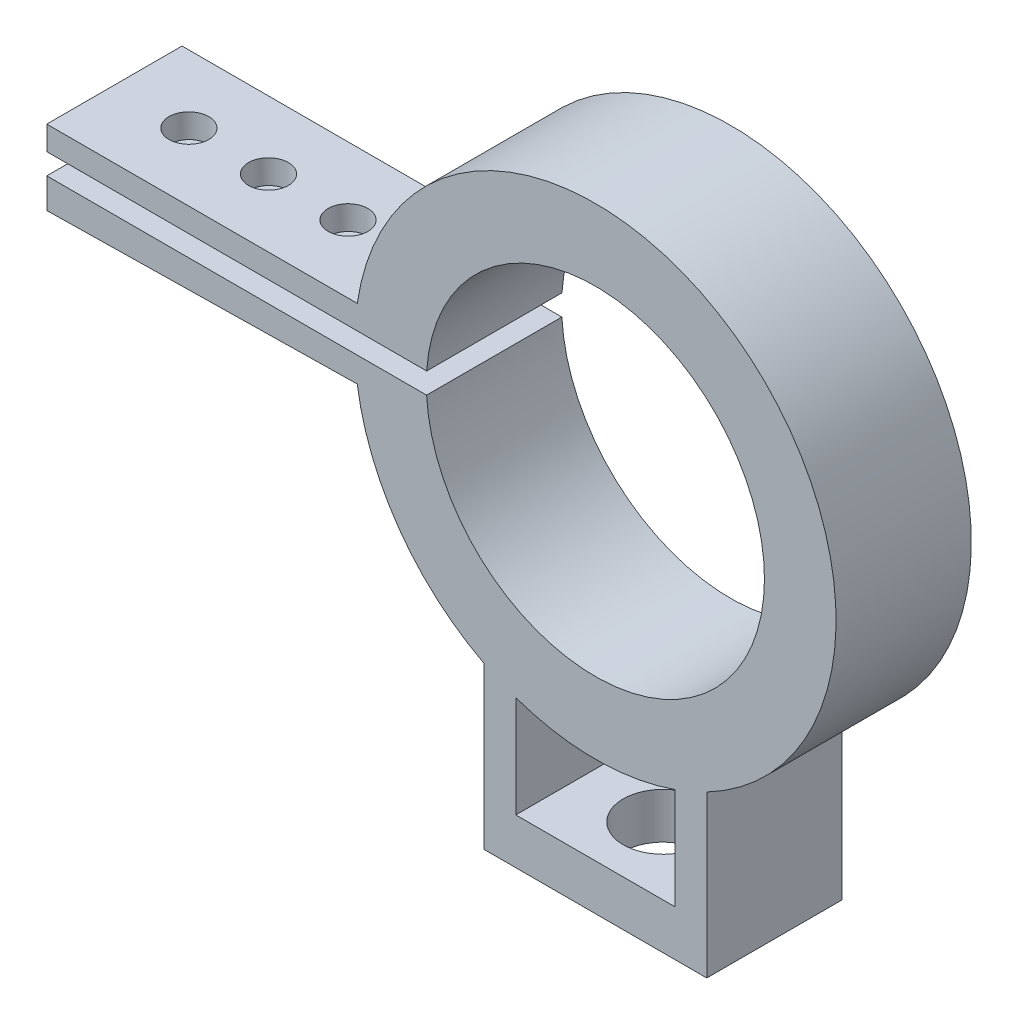
ISO-10303-21;
HEADER;
FILE_DESCRIPTION(('STEP AP214'),'2;1');
FILE_NAME('part.step','',(''),(''),'','','');
FILE_SCHEMA(('AUTOMOTIVE_DESIGN { 1 0 10303 214 1 1 1 1 }'));
ENDSEC;
DATA;
#1=APPLICATION_CONTEXT('core data for automotive mechanical design processes');
#2=APPLICATION_PROTOCOL_DEFINITION('international standard','automotive_design',2000,#1);
#3=PRODUCT_CONTEXT('',#1,'mechanical');
#4=PRODUCT('Part','Part','',(#3));
#5=PRODUCT_RELATED_PRODUCT_CATEGORY('part','',(#4));
#6=PRODUCT_DEFINITION_FORMATION('','',#4);
#7=PRODUCT_DEFINITION_CONTEXT('part definition',#1,'design');
#8=PRODUCT_DEFINITION('design','',#6,#7);
#9=PRODUCT_DEFINITION_SHAPE('','',#8);
#10=(LENGTH_UNIT() NAMED_UNIT(*) SI_UNIT(.MILLI.,.METRE.));
#11=(NAMED_UNIT(*) PLANE_ANGLE_UNIT() SI_UNIT($,.RADIAN.));
#12=(NAMED_UNIT(*) SI_UNIT($,.STERADIAN.) SOLID_ANGLE_UNIT());
#13=UNCERTAINTY_MEASURE_WITH_UNIT(LENGTH_MEASURE(1.E-05),#10,'distance_accuracy_value','');
#14=(GEOMETRIC_REPRESENTATION_CONTEXT(3) GLOBAL_UNCERTAINTY_ASSIGNED_CONTEXT((#13)) GLOBAL_UNIT_ASSIGNED_CONTEXT((#10,
#11,#12)) REPRESENTATION_CONTEXT('',''));
#15=CARTESIAN_POINT('',(0.,0.,0.));
#16=DIRECTION('',(0.,0.,1.));
#17=DIRECTION('',(1.,0.,0.));
#18=AXIS2_PLACEMENT_3D('',#15,#16,#17);
#19=CARTESIAN_POINT('',(0.,0.,17.));
#20=DIRECTION('',(0.,0.,-1.));
#21=DIRECTION('',(-1.,0.,0.));
#22=AXIS2_PLACEMENT_3D('',#19,#20,#21);
#23=CYLINDRICAL_SURFACE('',#22,30.25);
#24=CARTESIAN_POINT('',(0.,0.,0.));
#25=DIRECTION('',(0.,0.,1.));
#26=DIRECTION('',(1.,0.,0.));
#27=AXIS2_PLACEMENT_3D('',#24,#25,#26);
#28=CIRCLE('',#27,30.25);
#29=CARTESIAN_POINT('',(-29.9322407925561,-4.37303797564608,0.));
#30=VERTEX_POINT('',#29);
#31=CARTESIAN_POINT('',(-14.,-26.8153407586031,0.));
#32=VERTEX_POINT('',#31);
#33=EDGE_CURVE('E207',#30,#32,#28,.T.);
#34=ORIENTED_EDGE('',*,*,#33,.T.);
#35=DIRECTION('',(0.,0.,-1.));
#36=VECTOR('',#35,1.);
#37=CARTESIAN_POINT('',(-14.,-26.8153407586031,17.));
#38=LINE('',#37,#36);
#39=CARTESIAN_POINT('',(-14.,-26.8153407586031,17.));
#40=VERTEX_POINT('',#39);
#41=EDGE_CURVE('E11',#40,#32,#38,.T.);
#42=ORIENTED_EDGE('',*,*,#41,.F.);
#43=CARTESIAN_POINT('',(0.,0.,17.));
#44=DIRECTION('',(0.,0.,1.));
#45=DIRECTION('',(1.,0.,0.));
#46=AXIS2_PLACEMENT_3D('',#43,#44,#45);
#47=CIRCLE('',#46,30.25);
#48=CARTESIAN_POINT('',(-29.9322407925561,-4.37303797564608,17.));
#49=VERTEX_POINT('',#48);
#50=EDGE_CURVE('E311',#49,#40,#47,.T.);
#51=ORIENTED_EDGE('',*,*,#50,.F.);
#52=DIRECTION('',(0.,0.,-1.));
#53=VECTOR('',#52,1.);
#54=CARTESIAN_POINT('',(-29.9322407925561,-4.37303797564608,17.));
#55=LINE('',#54,#53);
#56=EDGE_CURVE('E248',#49,#30,#55,.T.);
#57=ORIENTED_EDGE('',*,*,#56,.T.);
#58=EDGE_LOOP('',(#34,#42,#51,#57));
#59=FACE_BOUND('',#58,.T.);
#60=ADVANCED_FACE('F41',(#59),#23,.T.);
#61=CARTESIAN_POINT('',(-14.,0.,17.));
#62=DIRECTION('',(1.,0.,0.));
#63=DIRECTION('',(0.,0.,-1.));
#64=AXIS2_PLACEMENT_3D('',#61,#62,#63);
#65=PLANE('',#64);
#66=DIRECTION('',(0.,-1.,0.));
#67=VECTOR('',#66,1.);
#68=CARTESIAN_POINT('',(-14.,0.,0.));
#69=LINE('',#68,#67);
#70=CARTESIAN_POINT('',(-14.,-47.0602881982245,0.));
#71=VERTEX_POINT('',#70);
#72=EDGE_CURVE('E211',#32,#71,#69,.T.);
#73=ORIENTED_EDGE('',*,*,#72,.T.);
#74=DIRECTION('',(0.,0.,-1.));
#75=VECTOR('',#74,1.);
#76=CARTESIAN_POINT('',(-14.,-47.0602881982245,17.));
#77=LINE('',#76,#75);
#78=CARTESIAN_POINT('',(-14.,-47.0602881982245,17.));
#79=VERTEX_POINT('',#78);
#80=EDGE_CURVE('E52',#79,#71,#77,.T.);
#81=ORIENTED_EDGE('',*,*,#80,.F.);
#82=DIRECTION('',(0.,-1.,0.));
#83=VECTOR('',#82,1.);
#84=CARTESIAN_POINT('',(-14.,0.,17.));
#85=LINE('',#84,#83);
#86=EDGE_CURVE('E316',#40,#79,#85,.T.);
#87=ORIENTED_EDGE('',*,*,#86,.F.);
#88=ORIENTED_EDGE('',*,*,#41,.T.);
#89=EDGE_LOOP('',(#73,#81,#87,#88));
#90=FACE_BOUND('',#89,.T.);
#91=ADVANCED_FACE('F368',(#90),#65,.F.);
#92=CARTESIAN_POINT('',(0.,-47.0602881982245,17.));
#93=DIRECTION('',(0.,1.,0.));
#94=DIRECTION('',(0.,0.,1.));
#95=AXIS2_PLACEMENT_3D('',#92,#93,#94);
#96=PLANE('',#95);
#97=CARTESIAN_POINT('',(0.,-47.0602881982245,8.5));
#98=DIRECTION('',(0.,-1.,0.));
#99=DIRECTION('',(0.,0.,-1.));
#100=AXIS2_PLACEMENT_3D('',#97,#98,#99);
#101=CIRCLE('',#100,5.);
#102=CARTESIAN_POINT('',(0.,-47.0602881982245,3.5));
#103=VERTEX_POINT('',#102);
#104=EDGE_CURVE('E391',#103,#103,#101,.T.);
#105=ORIENTED_EDGE('',*,*,#104,.F.);
#106=EDGE_LOOP('',(#105));
#107=FACE_BOUND('',#106,.T.);
#108=DIRECTION('',(1.,0.,0.));
#109=VECTOR('',#108,1.);
#110=CARTESIAN_POINT('',(0.,-47.0602881982245,0.));
#111=LINE('',#110,#109);
#112=CARTESIAN_POINT('',(14.,-47.0602881982245,0.));
#113=VERTEX_POINT('',#112);
#114=EDGE_CURVE('E214',#71,#113,#111,.T.);
#115=ORIENTED_EDGE('',*,*,#114,.T.);
#116=DIRECTION('',(0.,0.,-1.));
#117=VECTOR('',#116,1.);
#118=CARTESIAN_POINT('',(14.,-47.0602881982245,17.));
#119=LINE('',#118,#117);
#120=CARTESIAN_POINT('',(14.,-47.0602881982245,17.));
#121=VERTEX_POINT('',#120);
#122=EDGE_CURVE('E272',#121,#113,#119,.T.);
#123=ORIENTED_EDGE('',*,*,#122,.F.);
#124=DIRECTION('',(1.,0.,0.));
#125=VECTOR('',#124,1.);
#126=CARTESIAN_POINT('',(0.,-47.0602881982245,17.));
#127=LINE('',#126,#125);
#128=EDGE_CURVE('E323',#79,#121,#127,.T.);
#129=ORIENTED_EDGE('',*,*,#128,.F.);
#130=ORIENTED_EDGE('',*,*,#80,.T.);
#131=EDGE_LOOP('',(#115,#123,#129,#130));
#132=FACE_BOUND('',#131,.T.);
#133=ADVANCED_FACE('F373',(#107,#132),#96,.F.);
#134=CARTESIAN_POINT('',(14.,0.,17.));
#135=DIRECTION('',(-1.,0.,0.));
#136=DIRECTION('',(0.,-1.,0.));
#137=AXIS2_PLACEMENT_3D('',#134,#135,#136);
#138=PLANE('',#137);
#139=DIRECTION('',(0.,1.,0.));
#140=VECTOR('',#139,1.);
#141=CARTESIAN_POINT('',(14.,0.,0.));
#142=LINE('',#141,#140);
#143=CARTESIAN_POINT('',(14.,-26.8153407586031,0.));
#144=VERTEX_POINT('',#143);
#145=EDGE_CURVE('E217',#113,#144,#142,.T.);
#146=ORIENTED_EDGE('',*,*,#145,.T.);
#147=DIRECTION('',(0.,0.,-1.));
#148=VECTOR('',#147,1.);
#149=CARTESIAN_POINT('',(14.,-26.8153407586031,17.));
#150=LINE('',#149,#148);
#151=CARTESIAN_POINT('',(14.,-26.8153407586031,17.));
#152=VERTEX_POINT('',#151);
#153=EDGE_CURVE('E268',#152,#144,#150,.T.);
#154=ORIENTED_EDGE('',*,*,#153,.F.);
#155=DIRECTION('',(0.,1.,0.));
#156=VECTOR('',#155,1.);
#157=CARTESIAN_POINT('',(14.,0.,17.));
#158=LINE('',#157,#156);
#159=EDGE_CURVE('E326',#121,#152,#158,.T.);
#160=ORIENTED_EDGE('',*,*,#159,.F.);
#161=ORIENTED_EDGE('',*,*,#122,.T.);
#162=EDGE_LOOP('',(#146,#154,#160,#161));
#163=FACE_BOUND('',#162,.T.);
#164=ADVANCED_FACE('F487',(#163),#138,.F.);
#165=CARTESIAN_POINT('',(0.,0.,17.));
#166=DIRECTION('',(0.,0.,-1.));
#167=DIRECTION('',(-1.,0.,0.));
#168=AXIS2_PLACEMENT_3D('',#165,#166,#167);
#169=CYLINDRICAL_SURFACE('',#168,30.25);
#170=CARTESIAN_POINT('',(0.,0.,0.));
#171=DIRECTION('',(0.,0.,1.));
#172=DIRECTION('',(1.,0.,0.));
#173=AXIS2_PLACEMENT_3D('',#170,#171,#172);
#174=CIRCLE('',#173,30.25);
#175=CARTESIAN_POINT('',(-29.9274999124546,4.40536593145532,0.));
#176=VERTEX_POINT('',#175);
#177=EDGE_CURVE('E220',#144,#176,#174,.T.);
#178=ORIENTED_EDGE('',*,*,#177,.T.);
#179=DIRECTION('',(0.,0.,-1.));
#180=VECTOR('',#179,1.);
#181=CARTESIAN_POINT('',(-29.9274999124546,4.40536593145532,17.));
#182=LINE('',#181,#180);
#183=CARTESIAN_POINT('',(-29.9274999124546,4.40536593145532,17.));
#184=VERTEX_POINT('',#183);
#185=EDGE_CURVE('E265',#184,#176,#182,.T.);
#186=ORIENTED_EDGE('',*,*,#185,.F.);
#187=CARTESIAN_POINT('',(0.,0.,17.));
#188=DIRECTION('',(0.,0.,1.));
#189=DIRECTION('',(1.,0.,0.));
#190=AXIS2_PLACEMENT_3D('',#187,#188,#189);
#191=CIRCLE('',#190,30.25);
#192=EDGE_CURVE('E329',#152,#184,#191,.T.);
#193=ORIENTED_EDGE('',*,*,#192,.F.);
#194=ORIENTED_EDGE('',*,*,#153,.T.);
#195=EDGE_LOOP('',(#178,#186,#193,#194));
#196=FACE_BOUND('',#195,.T.);
#197=ADVANCED_FACE('F483',(#196),#169,.T.);
#198=CARTESIAN_POINT('',(0.,4.40536593145532,17.));
#199=DIRECTION('',(0.,1.,0.));
#200=DIRECTION('',(0.,0.,1.));
#201=AXIS2_PLACEMENT_3D('',#198,#199,#200);
#202=PLANE('',#201);
#203=CARTESIAN_POINT('',(-59.5889076622242,4.40536593145532,8.49999999999993));
#204=DIRECTION('',(0.,1.,0.));
#205=DIRECTION('',(1.,0.,0.));
#206=AXIS2_PLACEMENT_3D('',#203,#204,#205);
#207=ELLIPSE('',#206,2.50032271693993,2.5);
#208=CARTESIAN_POINT('',(-57.0885849452843,4.40536593145532,8.49999999999993));
#209=VERTEX_POINT('',#208);
#210=EDGE_CURVE('E394',#209,#209,#207,.T.);
#211=ORIENTED_EDGE('',*,*,#210,.F.);
#212=EDGE_LOOP('',(#211));
#213=FACE_BOUND('',#212,.T.);
#214=CARTESIAN_POINT('',(-39.5863259267049,4.40536593145532,8.5));
#215=DIRECTION('',(0.,1.,0.));
#216=DIRECTION('',(1.,0.,0.));
#217=AXIS2_PLACEMENT_3D('',#214,#215,#216);
#218=ELLIPSE('',#217,2.50032271693993,2.5);
#219=CARTESIAN_POINT('',(-37.0860032097649,4.40536593145532,8.5));
#220=VERTEX_POINT('',#219);
#221=EDGE_CURVE('E413',#220,#220,#218,.T.);
#222=ORIENTED_EDGE('',*,*,#221,.F.);
#223=EDGE_LOOP('',(#222));
#224=FACE_BOUND('',#223,.T.);
#225=CARTESIAN_POINT('',(-49.5876167944646,4.40536593145532,8.5));
#226=DIRECTION('',(0.,1.,0.));
#227=DIRECTION('',(1.,0.,0.));
#228=AXIS2_PLACEMENT_3D('',#225,#226,#227);
#229=ELLIPSE('',#228,2.50032271693992,2.5);
#230=CARTESIAN_POINT('',(-47.0872940775246,4.40536593145532,8.5));
#231=VERTEX_POINT('',#230);
#232=EDGE_CURVE('E425',#231,#231,#229,.T.);
#233=ORIENTED_EDGE('',*,*,#232,.F.);
#234=EDGE_LOOP('',(#233));
#235=FACE_BOUND('',#234,.T.);
#236=DIRECTION('',(1.,0.,0.));
#237=VECTOR('',#236,1.);
#238=CARTESIAN_POINT('',(0.,4.40536593145532,0.));
#239=LINE('',#238,#237);
#240=CARTESIAN_POINT('',(-68.9508105555163,4.40536593145532,0.));
#241=VERTEX_POINT('',#240);
#242=EDGE_CURVE('E224',#241,#176,#239,.T.);
#243=ORIENTED_EDGE('',*,*,#242,.F.);
#244=DIRECTION('',(0.,0.,-1.));
#245=VECTOR('',#244,1.);
#246=CARTESIAN_POINT('',(-68.9508105555163,4.40536593145532,17.));
#247=LINE('',#246,#245);
#248=CARTESIAN_POINT('',(-68.9508105555163,4.40536593145532,17.));
#249=VERTEX_POINT('',#248);
#250=EDGE_CURVE('E262',#249,#241,#247,.T.);
#251=ORIENTED_EDGE('',*,*,#250,.F.);
#252=DIRECTION('',(1.,0.,0.));
#253=VECTOR('',#252,1.);
#254=CARTESIAN_POINT('',(0.,4.40536593145532,17.));
#255=LINE('',#254,#253);
#256=EDGE_CURVE('E332',#249,#184,#255,.T.);
#257=ORIENTED_EDGE('',*,*,#256,.T.);
#258=ORIENTED_EDGE('',*,*,#185,.T.);
#259=EDGE_LOOP('',(#243,#251,#257,#258));
#260=FACE_BOUND('',#259,.T.);
#261=ADVANCED_FACE('F479',(#213,#224,#235,#260),#202,.T.);
#262=CARTESIAN_POINT('',(-68.9508105555163,0.,17.));
#263=DIRECTION('',(-1.,0.,0.));
#264=DIRECTION('',(0.,0.,1.));
#265=AXIS2_PLACEMENT_3D('',#262,#263,#264);
#266=PLANE('',#265);
#267=DIRECTION('',(0.,1.,0.));
#268=VECTOR('',#267,1.);
#269=CARTESIAN_POINT('',(-68.9508105555163,0.,0.));
#270=LINE('',#269,#268);
#271=CARTESIAN_POINT('',(-68.9508105555163,1.40536593145532,0.));
#272=VERTEX_POINT('',#271);
#273=EDGE_CURVE('E228',#272,#241,#270,.T.);
#274=ORIENTED_EDGE('',*,*,#273,.F.);
#275=DIRECTION('',(0.,0.,-1.));
#276=VECTOR('',#275,1.);
#277=CARTESIAN_POINT('',(-68.9508105555163,1.40536593145532,17.));
#278=LINE('',#277,#276);
#279=CARTESIAN_POINT('',(-68.9508105555163,1.40536593145532,17.));
#280=VERTEX_POINT('',#279);
#281=EDGE_CURVE('E259',#280,#272,#278,.T.);
#282=ORIENTED_EDGE('',*,*,#281,.F.);
#283=DIRECTION('',(0.,1.,0.));
#284=VECTOR('',#283,1.);
#285=CARTESIAN_POINT('',(-68.9508105555163,0.,17.));
#286=LINE('',#285,#284);
#287=EDGE_CURVE('E336',#280,#249,#286,.T.);
#288=ORIENTED_EDGE('',*,*,#287,.T.);
#289=ORIENTED_EDGE('',*,*,#250,.T.);
#290=EDGE_LOOP('',(#274,#282,#288,#289));
#291=FACE_BOUND('',#290,.T.);
#292=ADVANCED_FACE('F475',(#291),#266,.T.);
#293=CARTESIAN_POINT('',(0.,1.40536593145532,17.));
#294=DIRECTION('',(0.,-1.,0.));
#295=DIRECTION('',(0.,0.,-1.));
#296=AXIS2_PLACEMENT_3D('',#293,#294,#295);
#297=PLANE('',#296);
#298=CARTESIAN_POINT('',(-59.5407027668504,1.40536593145532,8.49999999999993));
#299=DIRECTION('',(0.,-1.,0.));
#300=DIRECTION('',(1.,0.,0.));
#301=AXIS2_PLACEMENT_3D('',#298,#299,#300);
#302=ELLIPSE('',#301,2.50032271693993,2.5);
#303=CARTESIAN_POINT('',(-57.0403800499104,1.40536593145532,8.49999999999993));
#304=VERTEX_POINT('',#303);
#305=EDGE_CURVE('E400',#304,#304,#302,.T.);
#306=ORIENTED_EDGE('',*,*,#305,.F.);
#307=EDGE_LOOP('',(#306));
#308=FACE_BOUND('',#307,.T.);
#309=CARTESIAN_POINT('',(-39.538121031331,1.40536593145532,8.5));
#310=DIRECTION('',(0.,-1.,0.));
#311=DIRECTION('',(1.,0.,0.));
#312=AXIS2_PLACEMENT_3D('',#309,#310,#311);
#313=ELLIPSE('',#312,2.50032271693993,2.5);
#314=CARTESIAN_POINT('',(-37.0377983143911,1.40536593145532,8.5));
#315=VERTEX_POINT('',#314);
#316=EDGE_CURVE('E417',#315,#315,#313,.T.);
#317=ORIENTED_EDGE('',*,*,#316,.F.);
#318=EDGE_LOOP('',(#317));
#319=FACE_BOUND('',#318,.T.);
#320=CARTESIAN_POINT('',(-49.5394118990907,1.40536593145532,8.5));
#321=DIRECTION('',(0.,-1.,0.));
#322=DIRECTION('',(1.,0.,0.));
#323=AXIS2_PLACEMENT_3D('',#320,#321,#322);
#324=ELLIPSE('',#323,2.50032271693992,2.5);
#325=CARTESIAN_POINT('',(-47.0390891821508,1.40536593145532,8.5));
#326=VERTEX_POINT('',#325);
#327=EDGE_CURVE('E429',#326,#326,#324,.T.);
#328=ORIENTED_EDGE('',*,*,#327,.F.);
#329=EDGE_LOOP('',(#328));
#330=FACE_BOUND('',#329,.T.);
#331=DIRECTION('',(-1.,0.,0.));
#332=VECTOR('',#331,1.);
#333=CARTESIAN_POINT('',(0.,1.40536593145532,0.));
#334=LINE('',#333,#332);
#335=CARTESIAN_POINT('',(-21.2034772289524,1.40536593145532,0.));
#336=VERTEX_POINT('',#335);
#337=EDGE_CURVE('E232',#336,#272,#334,.T.);
#338=ORIENTED_EDGE('',*,*,#337,.F.);
#339=DIRECTION('',(0.,0.,-1.));
#340=VECTOR('',#339,1.);
#341=CARTESIAN_POINT('',(-21.2034772289524,1.40536593145532,17.));
#342=LINE('',#341,#340);
#343=CARTESIAN_POINT('',(-21.2034772289524,1.40536593145532,17.));
#344=VERTEX_POINT('',#343);
#345=EDGE_CURVE('E256',#344,#336,#342,.T.);
#346=ORIENTED_EDGE('',*,*,#345,.F.);
#347=DIRECTION('',(-1.,0.,0.));
#348=VECTOR('',#347,1.);
#349=CARTESIAN_POINT('',(0.,1.40536593145532,17.));
#350=LINE('',#349,#348);
#351=EDGE_CURVE('E340',#344,#280,#350,.T.);
#352=ORIENTED_EDGE('',*,*,#351,.T.);
#353=ORIENTED_EDGE('',*,*,#281,.T.);
#354=EDGE_LOOP('',(#338,#346,#352,#353));
#355=FACE_BOUND('',#354,.T.);
#356=ADVANCED_FACE('F469',(#308,#319,#330,#355),#297,.T.);
#357=CARTESIAN_POINT('',(0.,0.,17.));
#358=DIRECTION('',(0.,0.,-1.));
#359=DIRECTION('',(-1.,0.,0.));
#360=AXIS2_PLACEMENT_3D('',#357,#358,#359);
#361=CYLINDRICAL_SURFACE('',#360,21.25);
#362=CARTESIAN_POINT('',(0.,0.,0.));
#363=DIRECTION('',(0.,0.,1.));
#364=DIRECTION('',(1.,0.,0.));
#365=AXIS2_PLACEMENT_3D('',#362,#363,#364);
#366=CIRCLE('',#365,21.25);
#367=CARTESIAN_POINT('',(-21.2145631797598,-1.22670660387081,0.));
#368=VERTEX_POINT('',#367);
#369=EDGE_CURVE('E236',#368,#336,#366,.T.);
#370=ORIENTED_EDGE('',*,*,#369,.F.);
#371=DIRECTION('',(0.,0.,-1.));
#372=VECTOR('',#371,1.);
#373=CARTESIAN_POINT('',(-21.2145631797598,-1.22670660387081,17.));
#374=LINE('',#373,#372);
#375=CARTESIAN_POINT('',(-21.2145631797598,-1.22670660387081,17.));
#376=VERTEX_POINT('',#375);
#377=EDGE_CURVE('E184',#376,#368,#374,.T.);
#378=ORIENTED_EDGE('',*,*,#377,.F.);
#379=CARTESIAN_POINT('',(0.,0.,17.));
#380=DIRECTION('',(0.,0.,1.));
#381=DIRECTION('',(1.,0.,0.));
#382=AXIS2_PLACEMENT_3D('',#379,#380,#381);
#383=CIRCLE('',#382,21.25);
#384=EDGE_CURVE('E171',#376,#344,#383,.T.);
#385=ORIENTED_EDGE('',*,*,#384,.T.);
#386=ORIENTED_EDGE('',*,*,#345,.T.);
#387=EDGE_LOOP('',(#370,#378,#385,#386));
#388=FACE_BOUND('',#387,.T.);
#389=ADVANCED_FACE('F346',(#388),#361,.F.);
#390=CARTESIAN_POINT('',(0.,-1.22670660387081,17.));
#391=DIRECTION('',(0.,-1.,0.));
#392=DIRECTION('',(0.,0.,-1.));
#393=AXIS2_PLACEMENT_3D('',#390,#391,#392);
#394=PLANE('',#393);
#395=CARTESIAN_POINT('',(-59.4984098397898,-1.22670660387081,8.49999999999993));
#396=DIRECTION('',(0.,-1.,0.));
#397=DIRECTION('',(1.,0.,0.));
#398=AXIS2_PLACEMENT_3D('',#395,#396,#397);
#399=ELLIPSE('',#398,2.50032271693993,2.5);
#400=CARTESIAN_POINT('',(-56.9980871228498,-1.22670660387081,8.49999999999993));
#401=VERTEX_POINT('',#400);
#402=EDGE_CURVE('E409',#401,#401,#399,.T.);
#403=ORIENTED_EDGE('',*,*,#402,.T.);
#404=EDGE_LOOP('',(#403));
#405=FACE_BOUND('',#404,.T.);
#406=CARTESIAN_POINT('',(-39.4958281042704,-1.22670660387081,8.5));
#407=DIRECTION('',(0.,-1.,0.));
#408=DIRECTION('',(1.,0.,0.));
#409=AXIS2_PLACEMENT_3D('',#406,#407,#408);
#410=ELLIPSE('',#409,2.50032271693993,2.5);
#411=CARTESIAN_POINT('',(-36.9955053873304,-1.22670660387081,8.5));
#412=VERTEX_POINT('',#411);
#413=EDGE_CURVE('E421',#412,#412,#410,.T.);
#414=ORIENTED_EDGE('',*,*,#413,.T.);
#415=EDGE_LOOP('',(#414));
#416=FACE_BOUND('',#415,.T.);
#417=CARTESIAN_POINT('',(-49.4971189720301,-1.22670660387081,8.5));
#418=DIRECTION('',(0.,-1.,0.));
#419=DIRECTION('',(1.,0.,0.));
#420=AXIS2_PLACEMENT_3D('',#417,#418,#419);
#421=ELLIPSE('',#420,2.50032271693992,2.5);
#422=CARTESIAN_POINT('',(-46.9967962550901,-1.22670660387081,8.5));
#423=VERTEX_POINT('',#422);
#424=EDGE_CURVE('E433',#423,#423,#421,.T.);
#425=ORIENTED_EDGE('',*,*,#424,.T.);
#426=EDGE_LOOP('',(#425));
#427=FACE_BOUND('',#426,.T.);
#428=DIRECTION('',(-1.,0.,0.));
#429=VECTOR('',#428,1.);
#430=CARTESIAN_POINT('',(0.,-1.22670660387081,0.));
#431=LINE('',#430,#429);
#432=CARTESIAN_POINT('',(-68.9508105555163,-1.22670660387081,0.));
#433=VERTEX_POINT('',#432);
#434=EDGE_CURVE('E179',#368,#433,#431,.T.);
#435=ORIENTED_EDGE('',*,*,#434,.T.);
#436=DIRECTION('',(0.,0.,-1.));
#437=VECTOR('',#436,1.);
#438=CARTESIAN_POINT('',(-68.9508105555163,-1.22670660387081,17.));
#439=LINE('',#438,#437);
#440=CARTESIAN_POINT('',(-68.9508105555163,-1.22670660387081,17.));
#441=VERTEX_POINT('',#440);
#442=EDGE_CURVE('E176',#441,#433,#439,.T.);
#443=ORIENTED_EDGE('',*,*,#442,.F.);
#444=DIRECTION('',(-1.,0.,0.));
#445=VECTOR('',#444,1.);
#446=CARTESIAN_POINT('',(0.,-1.22670660387081,17.));
#447=LINE('',#446,#445);
#448=EDGE_CURVE('E164',#376,#441,#447,.T.);
#449=ORIENTED_EDGE('',*,*,#448,.F.);
#450=ORIENTED_EDGE('',*,*,#377,.T.);
#451=EDGE_LOOP('',(#435,#443,#449,#450));
#452=FACE_BOUND('',#451,.T.);
#453=ADVANCED_FACE('F177',(#405,#416,#427,#452),#394,.F.);
#454=CARTESIAN_POINT('',(-68.9508105555163,0.,17.));
#455=DIRECTION('',(-1.,0.,0.));
#456=DIRECTION('',(0.,0.,1.));
#457=AXIS2_PLACEMENT_3D('',#454,#455,#456);
#458=PLANE('',#457);
#459=DIRECTION('',(0.,1.,0.));
#460=VECTOR('',#459,1.);
#461=CARTESIAN_POINT('',(-68.9508105555163,0.,0.));
#462=LINE('',#461,#460);
#463=CARTESIAN_POINT('',(-68.9508105555163,-5.,0.));
#464=VERTEX_POINT('',#463);
#465=EDGE_CURVE('E242',#464,#433,#462,.T.);
#466=ORIENTED_EDGE('',*,*,#465,.F.);
#467=DIRECTION('',(0.,0.,-1.));
#468=VECTOR('',#467,1.);
#469=CARTESIAN_POINT('',(-68.9508105555163,-5.,17.));
#470=LINE('',#469,#468);
#471=CARTESIAN_POINT('',(-68.9508105555163,-5.,17.));
#472=VERTEX_POINT('',#471);
#473=EDGE_CURVE('E113',#472,#464,#470,.T.);
#474=ORIENTED_EDGE('',*,*,#473,.F.);
#475=DIRECTION('',(0.,1.,0.));
#476=VECTOR('',#475,1.);
#477=CARTESIAN_POINT('',(-68.9508105555163,0.,17.));
#478=LINE('',#477,#476);
#479=EDGE_CURVE('E168',#472,#441,#478,.T.);
#480=ORIENTED_EDGE('',*,*,#479,.T.);
#481=ORIENTED_EDGE('',*,*,#442,.T.);
#482=EDGE_LOOP('',(#466,#474,#480,#481));
#483=FACE_BOUND('',#482,.T.);
#484=ADVANCED_FACE('F186',(#483),#458,.T.);
#485=CARTESIAN_POINT('',(0.,-41.3102881982245,17.));
#486=DIRECTION('',(0.,-1.,0.));
#487=DIRECTION('',(0.,0.,-1.));
#488=AXIS2_PLACEMENT_3D('',#485,#486,#487);
#489=PLANE('',#488);
#490=CARTESIAN_POINT('',(0.,-41.3102881982245,8.5));
#491=DIRECTION('',(0.,-1.,0.));
#492=DIRECTION('',(0.,0.,-1.));
#493=AXIS2_PLACEMENT_3D('',#490,#491,#492);
#494=CIRCLE('',#493,5.);
#495=CARTESIAN_POINT('',(0.,-41.3102881982245,3.5));
#496=VERTEX_POINT('',#495);
#497=EDGE_CURVE('E45',#496,#496,#494,.T.);
#498=ORIENTED_EDGE('',*,*,#497,.T.);
#499=EDGE_LOOP('',(#498));
#500=FACE_BOUND('',#499,.T.);
#501=DIRECTION('',(-1.,0.,0.));
#502=VECTOR('',#501,1.);
#503=CARTESIAN_POINT('',(0.,-41.3102881982245,0.));
#504=LINE('',#503,#502);
#505=CARTESIAN_POINT('',(10.,-41.3102881982245,0.));
#506=VERTEX_POINT('',#505);
#507=CARTESIAN_POINT('',(-9.99999999999999,-41.3102881982245,0.));
#508=VERTEX_POINT('',#507);
#509=EDGE_CURVE('E194',#506,#508,#504,.T.);
#510=ORIENTED_EDGE('',*,*,#509,.T.);
#511=DIRECTION('',(0.,0.,-1.));
#512=VECTOR('',#511,1.);
#513=CARTESIAN_POINT('',(-9.99999999999999,-41.3102881982245,17.));
#514=LINE('',#513,#512);
#515=CARTESIAN_POINT('',(-9.99999999999999,-41.3102881982245,17.));
#516=VERTEX_POINT('',#515);
#517=EDGE_CURVE('E251',#516,#508,#514,.T.);
#518=ORIENTED_EDGE('',*,*,#517,.F.);
#519=DIRECTION('',(-1.,0.,0.));
#520=VECTOR('',#519,1.);
#521=CARTESIAN_POINT('',(0.,-41.3102881982245,17.));
#522=LINE('',#521,#520);
#523=CARTESIAN_POINT('',(10.,-41.3102881982245,17.));
#524=VERTEX_POINT('',#523);
#525=EDGE_CURVE('E247',#524,#516,#522,.T.);
#526=ORIENTED_EDGE('',*,*,#525,.F.);
#527=DIRECTION('',(0.,0.,-1.));
#528=VECTOR('',#527,1.);
#529=CARTESIAN_POINT('',(10.,-41.3102881982245,17.));
#530=LINE('',#529,#528);
#531=EDGE_CURVE('E190',#524,#506,#530,.T.);
#532=ORIENTED_EDGE('',*,*,#531,.T.);
#533=EDGE_LOOP('',(#510,#518,#526,#532));
#534=FACE_BOUND('',#533,.T.);
#535=ADVANCED_FACE('F43',(#500,#534),#489,.F.);
#536=CARTESIAN_POINT('',(-9.99999999999999,0.,17.));
#537=DIRECTION('',(-1.,0.,0.));
#538=DIRECTION('',(0.,-1.,0.));
#539=AXIS2_PLACEMENT_3D('',#536,#537,#538);
#540=PLANE('',#539);
#541=DIRECTION('',(0.,1.,0.));
#542=VECTOR('',#541,1.);
#543=CARTESIAN_POINT('',(-9.99999999999999,0.,0.));
#544=LINE('',#543,#542);
#545=CARTESIAN_POINT('',(-9.99999999999999,-28.5492994660114,0.));
#546=VERTEX_POINT('',#545);
#547=EDGE_CURVE('E198',#508,#546,#544,.T.);
#548=ORIENTED_EDGE('',*,*,#547,.T.);
#549=DIRECTION('',(0.,0.,-1.));
#550=VECTOR('',#549,1.);
#551=CARTESIAN_POINT('',(-9.99999999999999,-28.5492994660114,17.));
#552=LINE('',#551,#550);
#553=CARTESIAN_POINT('',(-9.99999999999999,-28.5492994660114,17.));
#554=VERTEX_POINT('',#553);
#555=EDGE_CURVE('E286',#554,#546,#552,.T.);
#556=ORIENTED_EDGE('',*,*,#555,.F.);
#557=DIRECTION('',(0.,1.,0.));
#558=VECTOR('',#557,1.);
#559=CARTESIAN_POINT('',(-9.99999999999999,0.,17.));
#560=LINE('',#559,#558);
#561=EDGE_CURVE('E125',#516,#554,#560,.T.);
#562=ORIENTED_EDGE('',*,*,#561,.F.);
#563=ORIENTED_EDGE('',*,*,#517,.T.);
#564=EDGE_LOOP('',(#548,#556,#562,#563));
#565=FACE_BOUND('',#564,.T.);
#566=ADVANCED_FACE('F291',(#565),#540,.F.);
#567=CARTESIAN_POINT('',(0.,0.,17.));
#568=DIRECTION('',(0.,0.,-1.));
#569=DIRECTION('',(-1.,0.,0.));
#570=AXIS2_PLACEMENT_3D('',#567,#568,#569);
#571=CYLINDRICAL_SURFACE('',#570,30.25);
#572=CARTESIAN_POINT('',(0.,0.,0.));
#573=DIRECTION('',(0.,0.,1.));
#574=DIRECTION('',(1.,0.,0.));
#575=AXIS2_PLACEMENT_3D('',#572,#573,#574);
#576=CIRCLE('',#575,30.25);
#577=CARTESIAN_POINT('',(10.,-28.5492994660114,0.));
#578=VERTEX_POINT('',#577);
#579=EDGE_CURVE('E201',#546,#578,#576,.T.);
#580=ORIENTED_EDGE('',*,*,#579,.T.);
#581=DIRECTION('',(0.,0.,-1.));
#582=VECTOR('',#581,1.);
#583=CARTESIAN_POINT('',(10.,-28.5492994660114,17.));
#584=LINE('',#583,#582);
#585=CARTESIAN_POINT('',(10.,-28.5492994660114,17.));
#586=VERTEX_POINT('',#585);
#587=EDGE_CURVE('E282',#586,#578,#584,.T.);
#588=ORIENTED_EDGE('',*,*,#587,.F.);
#589=CARTESIAN_POINT('',(0.,0.,17.));
#590=DIRECTION('',(0.,0.,1.));
#591=DIRECTION('',(1.,0.,0.));
#592=AXIS2_PLACEMENT_3D('',#589,#590,#591);
#593=CIRCLE('',#592,30.25);
#594=EDGE_CURVE('E312',#554,#586,#593,.T.);
#595=ORIENTED_EDGE('',*,*,#594,.F.);
#596=ORIENTED_EDGE('',*,*,#555,.T.);
#597=EDGE_LOOP('',(#580,#588,#595,#596));
#598=FACE_BOUND('',#597,.T.);
#599=ADVANCED_FACE('F303',(#598),#571,.T.);
#600=CARTESIAN_POINT('',(10.,0.,17.));
#601=DIRECTION('',(1.,0.,0.));
#602=DIRECTION('',(0.,0.,-1.));
#603=AXIS2_PLACEMENT_3D('',#600,#601,#602);
#604=PLANE('',#603);
#605=DIRECTION('',(0.,-1.,0.));
#606=VECTOR('',#605,1.);
#607=CARTESIAN_POINT('',(10.,0.,0.));
#608=LINE('',#607,#606);
#609=EDGE_CURVE('E204',#578,#506,#608,.T.);
#610=ORIENTED_EDGE('',*,*,#609,.T.);
#611=ORIENTED_EDGE('',*,*,#531,.F.);
#612=DIRECTION('',(0.,-1.,0.));
#613=VECTOR('',#612,1.);
#614=CARTESIAN_POINT('',(10.,0.,17.));
#615=LINE('',#614,#613);
#616=EDGE_CURVE('E308',#586,#524,#615,.T.);
#617=ORIENTED_EDGE('',*,*,#616,.F.);
#618=ORIENTED_EDGE('',*,*,#587,.T.);
#619=EDGE_LOOP('',(#610,#611,#617,#618));
#620=FACE_BOUND('',#619,.T.);
#621=ADVANCED_FACE('F307',(#620),#604,.F.);
#622=CARTESIAN_POINT('',(0.0625229248575751,-3.89107316005874,17.));
#623=DIRECTION('',(-0.016066224520833,0.999870929885276,0.));
#624=DIRECTION('',(-0.999870929885276,-0.016066224520833,0.));
#625=AXIS2_PLACEMENT_3D('',#622,#623,#624);
#626=PLANE('',#625);
#627=CARTESIAN_POINT('',(-59.4402349728889,-4.84718123303137,8.49999999999993));
#628=DIRECTION('',(0.016066224520833,-0.999870929885276,0.));
#629=DIRECTION('',(0.999870929885276,0.016066224520833,0.));
#630=AXIS2_PLACEMENT_3D('',#627,#628,#629);
#631=CIRCLE('',#630,2.5);
#632=CARTESIAN_POINT('',(-56.9405576481757,-4.80701567172929,8.49999999999993));
#633=VERTEX_POINT('',#632);
#634=EDGE_CURVE('E442',#633,#633,#631,.T.);
#635=ORIENTED_EDGE('',*,*,#634,.F.);
#636=EDGE_LOOP('',(#635));
#637=FACE_BOUND('',#636,.T.);
#638=CARTESIAN_POINT('',(-39.4428163751834,-4.52585674261471,8.5));
#639=DIRECTION('',(0.016066224520833,-0.999870929885276,0.));
#640=DIRECTION('',(0.999870929885276,0.016066224520833,0.));
#641=AXIS2_PLACEMENT_3D('',#638,#639,#640);
#642=CIRCLE('',#641,2.5);
#643=CARTESIAN_POINT('',(-36.9431390504702,-4.48569118131263,8.5));
#644=VERTEX_POINT('',#643);
#645=EDGE_CURVE('E441',#644,#644,#642,.T.);
#646=ORIENTED_EDGE('',*,*,#645,.F.);
#647=EDGE_LOOP('',(#646));
#648=FACE_BOUND('',#647,.T.);
#649=CARTESIAN_POINT('',(-49.4415256740362,-4.68651898782304,8.5));
#650=DIRECTION('',(0.016066224520833,-0.999870929885276,0.));
#651=DIRECTION('',(0.999870929885276,0.016066224520833,0.));
#652=AXIS2_PLACEMENT_3D('',#649,#650,#651);
#653=CIRCLE('',#652,2.5);
#654=CARTESIAN_POINT('',(-46.941848349323,-4.64635342652096,8.5));
#655=VERTEX_POINT('',#654);
#656=EDGE_CURVE('E437',#655,#655,#653,.T.);
#657=ORIENTED_EDGE('',*,*,#656,.F.);
#658=EDGE_LOOP('',(#657));
#659=FACE_BOUND('',#658,.T.);
#660=DIRECTION('',(0.999870929885276,0.016066224520833,0.));
#661=VECTOR('',#660,1.);
#662=CARTESIAN_POINT('',(0.0625229248575751,-3.89107316005874,0.));
#663=LINE('',#662,#661);
#664=EDGE_CURVE('E116',#464,#30,#663,.T.);
#665=ORIENTED_EDGE('',*,*,#664,.T.);
#666=ORIENTED_EDGE('',*,*,#56,.F.);
#667=DIRECTION('',(0.999870929885276,0.016066224520833,0.));
#668=VECTOR('',#667,1.);
#669=CARTESIAN_POINT('',(0.0625229248575751,-3.89107316005874,17.));
#670=LINE('',#669,#668);
#671=EDGE_CURVE('E61',#472,#49,#670,.T.);
#672=ORIENTED_EDGE('',*,*,#671,.F.);
#673=ORIENTED_EDGE('',*,*,#473,.T.);
#674=EDGE_LOOP('',(#665,#666,#672,#673));
#675=FACE_BOUND('',#674,.T.);
#676=ADVANCED_FACE('F353',(#637,#648,#659,#675),#626,.F.);
#677=CARTESIAN_POINT('',(0.,0.,17.));
#678=DIRECTION('',(0.,0.,1.));
#679=DIRECTION('',(1.,0.,0.));
#680=AXIS2_PLACEMENT_3D('',#677,#678,#679);
#681=PLANE('',#680);
#682=ORIENTED_EDGE('',*,*,#525,.T.);
#683=ORIENTED_EDGE('',*,*,#561,.T.);
#684=ORIENTED_EDGE('',*,*,#594,.T.);
#685=ORIENTED_EDGE('',*,*,#616,.T.);
#686=EDGE_LOOP('',(#682,#683,#684,#685));
#687=FACE_BOUND('',#686,.T.);
#688=ORIENTED_EDGE('',*,*,#50,.T.);
#689=ORIENTED_EDGE('',*,*,#86,.T.);
#690=ORIENTED_EDGE('',*,*,#128,.T.);
#691=ORIENTED_EDGE('',*,*,#159,.T.);
#692=ORIENTED_EDGE('',*,*,#192,.T.);
#693=ORIENTED_EDGE('',*,*,#256,.F.);
#694=ORIENTED_EDGE('',*,*,#287,.F.);
#695=ORIENTED_EDGE('',*,*,#351,.F.);
#696=ORIENTED_EDGE('',*,*,#384,.F.);
#697=ORIENTED_EDGE('',*,*,#448,.T.);
#698=ORIENTED_EDGE('',*,*,#479,.F.);
#699=ORIENTED_EDGE('',*,*,#671,.T.);
#700=EDGE_LOOP('',(#688,#689,#690,#691,#692,#693,#694,#695,#696,#697,#698,#699));
#701=FACE_BOUND('',#700,.T.);
#702=ADVANCED_FACE('F166',(#687,#701),#681,.T.);
#703=CARTESIAN_POINT('',(0.,0.,0.));
#704=DIRECTION('',(0.,0.,1.));
#705=DIRECTION('',(1.,0.,0.));
#706=AXIS2_PLACEMENT_3D('',#703,#704,#705);
#707=PLANE('',#706);
#708=ORIENTED_EDGE('',*,*,#509,.F.);
#709=ORIENTED_EDGE('',*,*,#609,.F.);
#710=ORIENTED_EDGE('',*,*,#579,.F.);
#711=ORIENTED_EDGE('',*,*,#547,.F.);
#712=EDGE_LOOP('',(#708,#709,#710,#711));
#713=FACE_BOUND('',#712,.T.);
#714=ORIENTED_EDGE('',*,*,#33,.F.);
#715=ORIENTED_EDGE('',*,*,#664,.F.);
#716=ORIENTED_EDGE('',*,*,#465,.T.);
#717=ORIENTED_EDGE('',*,*,#434,.F.);
#718=ORIENTED_EDGE('',*,*,#369,.T.);
#719=ORIENTED_EDGE('',*,*,#337,.T.);
#720=ORIENTED_EDGE('',*,*,#273,.T.);
#721=ORIENTED_EDGE('',*,*,#242,.T.);
#722=ORIENTED_EDGE('',*,*,#177,.F.);
#723=ORIENTED_EDGE('',*,*,#145,.F.);
#724=ORIENTED_EDGE('',*,*,#114,.F.);
#725=ORIENTED_EDGE('',*,*,#72,.F.);
#726=EDGE_LOOP('',(#714,#715,#716,#717,#718,#719,#720,#721,#722,#723,#724,#725));
#727=FACE_BOUND('',#726,.T.);
#728=ADVANCED_FACE('F298',(#713,#727),#707,.F.);
#729=CARTESIAN_POINT('',(0.,-40.0602881982245,8.5));
#730=DIRECTION('',(0.,-1.,0.));
#731=DIRECTION('',(0.,0.,-1.));
#732=AXIS2_PLACEMENT_3D('',#729,#730,#731);
#733=CYLINDRICAL_SURFACE('',#732,5.);
#734=ORIENTED_EDGE('',*,*,#104,.T.);
#735=EDGE_LOOP('',(#734));
#736=FACE_BOUND('',#735,.T.);
#737=ORIENTED_EDGE('',*,*,#497,.F.);
#738=EDGE_LOOP('',(#737));
#739=FACE_BOUND('',#738,.T.);
#740=ADVANCED_FACE('F458',(#736,#739),#733,.F.);
#741=CARTESIAN_POINT('',(-49.7146514908903,12.3112868202266,8.5));
#742=DIRECTION('',(0.016066224520833,-0.999870929885276,0.));
#743=DIRECTION('',(0.999870929885276,0.016066224520833,0.));
#744=AXIS2_PLACEMENT_3D('',#741,#742,#743);
#745=CYLINDRICAL_SURFACE('',#744,2.5);
#746=ORIENTED_EDGE('',*,*,#656,.T.);
#747=EDGE_LOOP('',(#746));
#748=FACE_BOUND('',#747,.T.);
#749=ORIENTED_EDGE('',*,*,#424,.F.);
#750=EDGE_LOOP('',(#749));
#751=FACE_BOUND('',#750,.T.);
#752=ADVANCED_FACE('F455',(#748,#751),#745,.F.);
#753=CARTESIAN_POINT('',(-39.7159421920376,12.471949065435,8.5));
#754=DIRECTION('',(0.016066224520833,-0.999870929885276,0.));
#755=DIRECTION('',(0.999870929885276,0.016066224520833,0.));
#756=AXIS2_PLACEMENT_3D('',#753,#754,#755);
#757=CYLINDRICAL_SURFACE('',#756,2.5);
#758=ORIENTED_EDGE('',*,*,#645,.T.);
#759=EDGE_LOOP('',(#758));
#760=FACE_BOUND('',#759,.T.);
#761=ORIENTED_EDGE('',*,*,#413,.F.);
#762=EDGE_LOOP('',(#761));
#763=FACE_BOUND('',#762,.T.);
#764=ADVANCED_FACE('F450',(#760,#763),#757,.F.);
#765=CARTESIAN_POINT('',(-59.7133607897431,12.1506245750183,8.49999999999993));
#766=DIRECTION('',(0.016066224520833,-0.999870929885276,0.));
#767=DIRECTION('',(0.999870929885276,0.016066224520833,0.));
#768=AXIS2_PLACEMENT_3D('',#765,#766,#767);
#769=CYLINDRICAL_SURFACE('',#768,2.5);
#770=ORIENTED_EDGE('',*,*,#634,.T.);
#771=EDGE_LOOP('',(#770));
#772=FACE_BOUND('',#771,.T.);
#773=ORIENTED_EDGE('',*,*,#402,.F.);
#774=EDGE_LOOP('',(#773));
#775=FACE_BOUND('',#774,.T.);
#776=ADVANCED_FACE('F596',(#772,#775),#769,.F.);
#777=ORIENTED_EDGE('',*,*,#232,.T.);
#778=EDGE_LOOP('',(#777));
#779=FACE_BOUND('',#778,.T.);
#780=ORIENTED_EDGE('',*,*,#327,.T.);
#781=EDGE_LOOP('',(#780));
#782=FACE_BOUND('',#781,.T.);
#783=ADVANCED_FACE('F460',(#779,#782),#745,.F.);
#784=ORIENTED_EDGE('',*,*,#221,.T.);
#785=EDGE_LOOP('',(#784));
#786=FACE_BOUND('',#785,.T.);
#787=ORIENTED_EDGE('',*,*,#316,.T.);
#788=EDGE_LOOP('',(#787));
#789=FACE_BOUND('',#788,.T.);
#790=ADVANCED_FACE('F598',(#786,#789),#757,.F.);
#791=ORIENTED_EDGE('',*,*,#210,.T.);
#792=EDGE_LOOP('',(#791));
#793=FACE_BOUND('',#792,.T.);
#794=ORIENTED_EDGE('',*,*,#305,.T.);
#795=EDGE_LOOP('',(#794));
#796=FACE_BOUND('',#795,.T.);
#797=ADVANCED_FACE('F606',(#793,#796),#769,.F.);
#798=CLOSED_SHELL('',(#60,#91,#133,#164,#197,#261,#292,#356,#389,#453,#484,#535,#566,#599,#621,
#676,#702,#728,#740,#752,#764,#776,#783,#790,#797));
#799=MANIFOLD_SOLID_BREP('B2',#798);
#800=ADVANCED_BREP_SHAPE_REPRESENTATION('',(#18,#799),#14);
#801=SHAPE_DEFINITION_REPRESENTATION(#9,#800);
ENDSEC;
END-ISO-10303-21;
